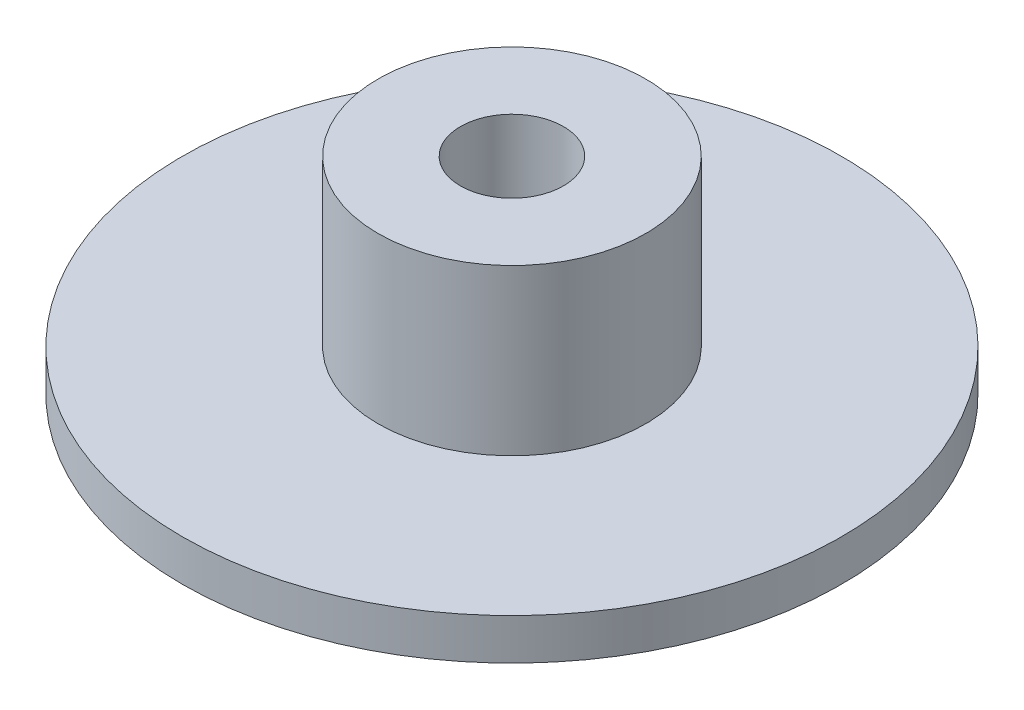
ISO-10303-21;
HEADER;
FILE_DESCRIPTION(('STEP AP214'),'2;1');
FILE_NAME('part.step','',(''),(''),'','','');
FILE_SCHEMA(('AUTOMOTIVE_DESIGN { 1 0 10303 214 1 1 1 1 }'));
ENDSEC;
DATA;
#1=APPLICATION_CONTEXT('core data for automotive mechanical design processes');
#2=APPLICATION_PROTOCOL_DEFINITION('international standard','automotive_design',2000,#1);
#3=PRODUCT_CONTEXT('',#1,'mechanical');
#4=PRODUCT('Part','Part','',(#3));
#5=PRODUCT_RELATED_PRODUCT_CATEGORY('part','',(#4));
#6=PRODUCT_DEFINITION_FORMATION('','',#4);
#7=PRODUCT_DEFINITION_CONTEXT('part definition',#1,'design');
#8=PRODUCT_DEFINITION('design','',#6,#7);
#9=PRODUCT_DEFINITION_SHAPE('','',#8);
#10=(LENGTH_UNIT() NAMED_UNIT(*) SI_UNIT(.MILLI.,.METRE.));
#11=(NAMED_UNIT(*) PLANE_ANGLE_UNIT() SI_UNIT($,.RADIAN.));
#12=(NAMED_UNIT(*) SI_UNIT($,.STERADIAN.) SOLID_ANGLE_UNIT());
#13=UNCERTAINTY_MEASURE_WITH_UNIT(LENGTH_MEASURE(1.E-05),#10,'distance_accuracy_value','');
#14=(GEOMETRIC_REPRESENTATION_CONTEXT(3) GLOBAL_UNCERTAINTY_ASSIGNED_CONTEXT((#13)) GLOBAL_UNIT_ASSIGNED_CONTEXT((#10,
#11,#12)) REPRESENTATION_CONTEXT('',''));
#15=CARTESIAN_POINT('',(0.,0.,0.));
#16=DIRECTION('',(0.,0.,1.));
#17=DIRECTION('',(1.,0.,0.));
#18=AXIS2_PLACEMENT_3D('',#15,#16,#17);
#19=CARTESIAN_POINT('',(0.,2.,0.));
#20=DIRECTION('',(0.,1.,0.));
#21=DIRECTION('',(0.,0.,1.));
#22=AXIS2_PLACEMENT_3D('',#19,#20,#21);
#23=PLANE('',#22);
#24=CARTESIAN_POINT('',(0.,2.,0.));
#25=DIRECTION('',(0.,1.,0.));
#26=DIRECTION('',(0.,0.,1.));
#27=AXIS2_PLACEMENT_3D('',#24,#25,#26);
#28=CIRCLE('',#27,16.);
#29=CARTESIAN_POINT('',(0.,2.,16.));
#30=VERTEX_POINT('',#29);
#31=EDGE_CURVE('E10',#30,#30,#28,.T.);
#32=ORIENTED_EDGE('',*,*,#31,.T.);
#33=EDGE_LOOP('',(#32));
#34=FACE_BOUND('',#33,.T.);
#35=CARTESIAN_POINT('',(0.,2.,0.));
#36=DIRECTION('',(0.,1.,0.));
#37=DIRECTION('',(0.,0.,1.));
#38=AXIS2_PLACEMENT_3D('',#35,#36,#37);
#39=CIRCLE('',#38,6.5);
#40=CARTESIAN_POINT('',(0.,2.,6.5));
#41=VERTEX_POINT('',#40);
#42=EDGE_CURVE('E49',#41,#41,#39,.T.);
#43=ORIENTED_EDGE('',*,*,#42,.F.);
#44=EDGE_LOOP('',(#43));
#45=FACE_BOUND('',#44,.T.);
#46=ADVANCED_FACE('F33',(#34,#45),#23,.T.);
#47=CARTESIAN_POINT('',(0.,0.,0.));
#48=DIRECTION('',(0.,1.,0.));
#49=DIRECTION('',(0.,0.,1.));
#50=AXIS2_PLACEMENT_3D('',#47,#48,#49);
#51=PLANE('',#50);
#52=CARTESIAN_POINT('',(0.,0.,0.));
#53=DIRECTION('',(0.,1.,0.));
#54=DIRECTION('',(0.,0.,1.));
#55=AXIS2_PLACEMENT_3D('',#52,#53,#54);
#56=CIRCLE('',#55,16.);
#57=CARTESIAN_POINT('',(0.,0.,16.));
#58=VERTEX_POINT('',#57);
#59=EDGE_CURVE('E37',#58,#58,#56,.T.);
#60=ORIENTED_EDGE('',*,*,#59,.F.);
#61=EDGE_LOOP('',(#60));
#62=FACE_BOUND('',#61,.T.);
#63=CARTESIAN_POINT('',(0.,0.,0.));
#64=DIRECTION('',(0.,1.,0.));
#65=DIRECTION('',(0.,0.,1.));
#66=AXIS2_PLACEMENT_3D('',#63,#64,#65);
#67=CIRCLE('',#66,2.5);
#68=CARTESIAN_POINT('',(0.,0.,2.5));
#69=VERTEX_POINT('',#68);
#70=EDGE_CURVE('E44',#69,#69,#67,.T.);
#71=ORIENTED_EDGE('',*,*,#70,.T.);
#72=EDGE_LOOP('',(#71));
#73=FACE_BOUND('',#72,.T.);
#74=ADVANCED_FACE('F74',(#62,#73),#51,.F.);
#75=CARTESIAN_POINT('',(0.,2.,0.));
#76=DIRECTION('',(0.,-1.,0.));
#77=DIRECTION('',(0.,0.,-1.));
#78=AXIS2_PLACEMENT_3D('',#75,#76,#77);
#79=CYLINDRICAL_SURFACE('',#78,16.);
#80=ORIENTED_EDGE('',*,*,#31,.F.);
#81=EDGE_LOOP('',(#80));
#82=FACE_BOUND('',#81,.T.);
#83=ORIENTED_EDGE('',*,*,#59,.T.);
#84=EDGE_LOOP('',(#83));
#85=FACE_BOUND('',#84,.T.);
#86=ADVANCED_FACE('F35',(#82,#85),#79,.T.);
#87=CARTESIAN_POINT('',(0.,2.,0.));
#88=DIRECTION('',(0.,-1.,0.));
#89=DIRECTION('',(0.,0.,-1.));
#90=AXIS2_PLACEMENT_3D('',#87,#88,#89);
#91=CYLINDRICAL_SURFACE('',#90,2.5);
#92=ORIENTED_EDGE('',*,*,#70,.F.);
#93=EDGE_LOOP('',(#92));
#94=FACE_BOUND('',#93,.T.);
#95=CARTESIAN_POINT('',(0.,10.,0.));
#96=DIRECTION('',(0.,1.,0.));
#97=DIRECTION('',(0.,0.,1.));
#98=AXIS2_PLACEMENT_3D('',#95,#96,#97);
#99=CIRCLE('',#98,2.5);
#100=CARTESIAN_POINT('',(0.,10.,2.5));
#101=VERTEX_POINT('',#100);
#102=EDGE_CURVE('E52',#101,#101,#99,.T.);
#103=ORIENTED_EDGE('',*,*,#102,.T.);
#104=EDGE_LOOP('',(#103));
#105=FACE_BOUND('',#104,.T.);
#106=ADVANCED_FACE('F58',(#94,#105),#91,.F.);
#107=CARTESIAN_POINT('',(0.,10.,0.));
#108=DIRECTION('',(0.,1.,0.));
#109=DIRECTION('',(0.,0.,1.));
#110=AXIS2_PLACEMENT_3D('',#107,#108,#109);
#111=PLANE('',#110);
#112=CARTESIAN_POINT('',(0.,10.,0.));
#113=DIRECTION('',(0.,1.,0.));
#114=DIRECTION('',(0.,0.,1.));
#115=AXIS2_PLACEMENT_3D('',#112,#113,#114);
#116=CIRCLE('',#115,6.5);
#117=CARTESIAN_POINT('',(0.,10.,6.5));
#118=VERTEX_POINT('',#117);
#119=EDGE_CURVE('E48',#118,#118,#116,.T.);
#120=ORIENTED_EDGE('',*,*,#119,.T.);
#121=EDGE_LOOP('',(#120));
#122=FACE_BOUND('',#121,.T.);
#123=ORIENTED_EDGE('',*,*,#102,.F.);
#124=EDGE_LOOP('',(#123));
#125=FACE_BOUND('',#124,.T.);
#126=ADVANCED_FACE('F60',(#122,#125),#111,.T.);
#127=CARTESIAN_POINT('',(0.,10.,0.));
#128=DIRECTION('',(0.,-1.,0.));
#129=DIRECTION('',(0.,0.,-1.));
#130=AXIS2_PLACEMENT_3D('',#127,#128,#129);
#131=CYLINDRICAL_SURFACE('',#130,6.5);
#132=ORIENTED_EDGE('',*,*,#119,.F.);
#133=EDGE_LOOP('',(#132));
#134=FACE_BOUND('',#133,.T.);
#135=ORIENTED_EDGE('',*,*,#42,.T.);
#136=EDGE_LOOP('',(#135));
#137=FACE_BOUND('',#136,.T.);
#138=ADVANCED_FACE('F62',(#134,#137),#131,.T.);
#139=CLOSED_SHELL('',(#46,#74,#86,#106,#126,#138));
#140=MANIFOLD_SOLID_BREP('B2',#139);
#141=ADVANCED_BREP_SHAPE_REPRESENTATION('',(#18,#140),#14);
#142=SHAPE_DEFINITION_REPRESENTATION(#9,#141);
ENDSEC;
END-ISO-10303-21;
